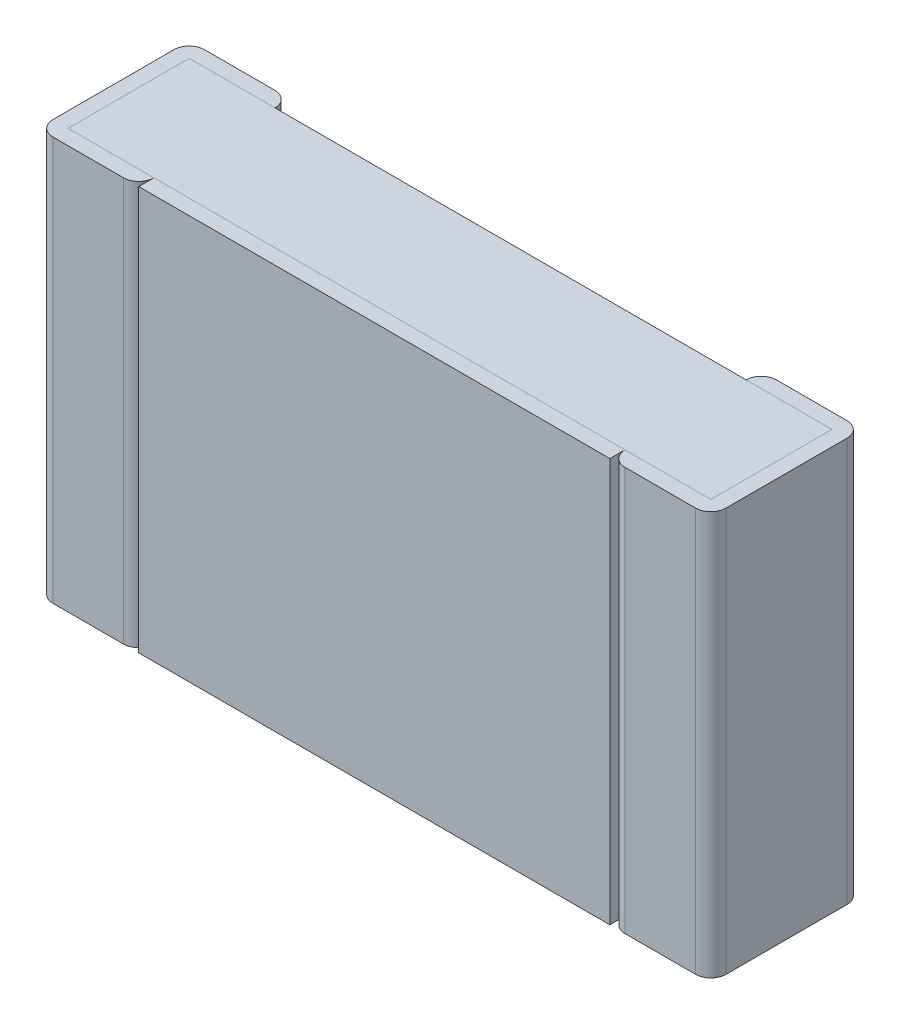
ISO-10303-21;
HEADER;
FILE_DESCRIPTION(('STEP AP214'),'2;1');
FILE_NAME('part.step','',(''),(''),'','','');
FILE_SCHEMA(('AUTOMOTIVE_DESIGN { 1 0 10303 214 1 1 1 1 }'));
ENDSEC;
DATA;
#1=APPLICATION_CONTEXT('core data for automotive mechanical design processes');
#2=APPLICATION_PROTOCOL_DEFINITION('international standard','automotive_design',2000,#1);
#3=PRODUCT_CONTEXT('',#1,'mechanical');
#4=PRODUCT('Part','Part','',(#3));
#5=PRODUCT_RELATED_PRODUCT_CATEGORY('part','',(#4));
#6=PRODUCT_DEFINITION_FORMATION('','',#4);
#7=PRODUCT_DEFINITION_CONTEXT('part definition',#1,'design');
#8=PRODUCT_DEFINITION('design','',#6,#7);
#9=PRODUCT_DEFINITION_SHAPE('','',#8);
#10=(LENGTH_UNIT() NAMED_UNIT(*) SI_UNIT(.MILLI.,.METRE.));
#11=(NAMED_UNIT(*) PLANE_ANGLE_UNIT() SI_UNIT($,.RADIAN.));
#12=(NAMED_UNIT(*) SI_UNIT($,.STERADIAN.) SOLID_ANGLE_UNIT());
#13=UNCERTAINTY_MEASURE_WITH_UNIT(LENGTH_MEASURE(1.E-05),#10,'distance_accuracy_value','');
#14=(GEOMETRIC_REPRESENTATION_CONTEXT(3) GLOBAL_UNCERTAINTY_ASSIGNED_CONTEXT((#13)) GLOBAL_UNIT_ASSIGNED_CONTEXT((#10,
#11,#12)) REPRESENTATION_CONTEXT('',''));
#15=CARTESIAN_POINT('',(0.,0.,0.));
#16=DIRECTION('',(0.,0.,1.));
#17=DIRECTION('',(1.,0.,0.));
#18=AXIS2_PLACEMENT_3D('',#15,#16,#17);
#19=CARTESIAN_POINT('',(-1.,-0.6,0.));
#20=DIRECTION('',(1.,0.,0.));
#21=DIRECTION('',(0.,1.,0.));
#22=AXIS2_PLACEMENT_3D('',#19,#20,#21);
#23=PLANE('',#22);
#24=DIRECTION('',(0.,1.,0.));
#25=VECTOR('',#24,1.);
#26=CARTESIAN_POINT('',(-1.,-0.6,0.405));
#27=LINE('',#26,#25);
#28=CARTESIAN_POINT('',(-1.,-0.6,0.405));
#29=VERTEX_POINT('',#28);
#30=CARTESIAN_POINT('',(-1.,0.6,0.405));
#31=VERTEX_POINT('',#30);
#32=EDGE_CURVE('E11',#29,#31,#27,.T.);
#33=ORIENTED_EDGE('',*,*,#32,.T.);
#34=DIRECTION('',(0.,0.,1.));
#35=VECTOR('',#34,1.);
#36=CARTESIAN_POINT('',(-1.,0.6,0.));
#37=LINE('',#36,#35);
#38=CARTESIAN_POINT('',(-1.,0.6,0.045));
#39=VERTEX_POINT('',#38);
#40=EDGE_CURVE('E41',#39,#31,#37,.T.);
#41=ORIENTED_EDGE('',*,*,#40,.F.);
#42=DIRECTION('',(0.,1.,0.));
#43=VECTOR('',#42,1.);
#44=CARTESIAN_POINT('',(-1.,-0.6,0.045));
#45=LINE('',#44,#43);
#46=CARTESIAN_POINT('',(-1.,-0.6,0.045));
#47=VERTEX_POINT('',#46);
#48=EDGE_CURVE('E361',#47,#39,#45,.T.);
#49=ORIENTED_EDGE('',*,*,#48,.F.);
#50=DIRECTION('',(0.,0.,1.));
#51=VECTOR('',#50,1.);
#52=CARTESIAN_POINT('',(-1.,-0.6,0.));
#53=LINE('',#52,#51);
#54=EDGE_CURVE('E27',#47,#29,#53,.T.);
#55=ORIENTED_EDGE('',*,*,#54,.T.);
#56=EDGE_LOOP('',(#33,#41,#49,#55));
#57=FACE_BOUND('',#56,.T.);
#58=ADVANCED_FACE('F16',(#57),#23,.F.);
#59=CARTESIAN_POINT('',(-1.,-0.6,0.));
#60=DIRECTION('',(0.,1.,0.));
#61=DIRECTION('',(1.,0.,0.));
#62=AXIS2_PLACEMENT_3D('',#59,#60,#61);
#63=PLANE('',#62);
#64=CARTESIAN_POINT('',(-0.745,-0.6,0.045));
#65=DIRECTION('',(0.,1.,0.));
#66=DIRECTION('',(0.,0.,1.));
#67=AXIS2_PLACEMENT_3D('',#64,#65,#66);
#68=CIRCLE('',#67,0.045);
#69=CARTESIAN_POINT('',(-0.7,-0.6,0.045));
#70=VERTEX_POINT('',#69);
#71=CARTESIAN_POINT('',(-0.745,-0.6,0.));
#72=VERTEX_POINT('',#71);
#73=EDGE_CURVE('E266',#70,#72,#68,.T.);
#74=ORIENTED_EDGE('',*,*,#73,.F.);
#75=DIRECTION('',(1.,0.,0.));
#76=VECTOR('',#75,1.);
#77=CARTESIAN_POINT('',(-0.955,-0.6,0.045));
#78=LINE('',#77,#76);
#79=CARTESIAN_POINT('',(-0.955,-0.6,0.045));
#80=VERTEX_POINT('',#79);
#81=EDGE_CURVE('E262',#80,#70,#78,.T.);
#82=ORIENTED_EDGE('',*,*,#81,.F.);
#83=DIRECTION('',(0.,0.,1.));
#84=VECTOR('',#83,1.);
#85=CARTESIAN_POINT('',(-0.955,-0.6,0.045));
#86=LINE('',#85,#84);
#87=CARTESIAN_POINT('',(-0.955,-0.6,0.405));
#88=VERTEX_POINT('',#87);
#89=EDGE_CURVE('E275',#80,#88,#86,.T.);
#90=ORIENTED_EDGE('',*,*,#89,.T.);
#91=DIRECTION('',(1.,0.,0.));
#92=VECTOR('',#91,1.);
#93=CARTESIAN_POINT('',(-0.955,-0.6,0.405));
#94=LINE('',#93,#92);
#95=CARTESIAN_POINT('',(-0.7,-0.6,0.405));
#96=VERTEX_POINT('',#95);
#97=EDGE_CURVE('E349',#88,#96,#94,.T.);
#98=ORIENTED_EDGE('',*,*,#97,.T.);
#99=CARTESIAN_POINT('',(-0.745,-0.6,0.405));
#100=DIRECTION('',(0.,-1.,0.));
#101=DIRECTION('',(0.,0.,1.));
#102=AXIS2_PLACEMENT_3D('',#99,#100,#101);
#103=CIRCLE('',#102,0.045);
#104=CARTESIAN_POINT('',(-0.745,-0.6,0.45));
#105=VERTEX_POINT('',#104);
#106=EDGE_CURVE('E240',#96,#105,#103,.T.);
#107=ORIENTED_EDGE('',*,*,#106,.T.);
#108=DIRECTION('',(1.,0.,0.));
#109=VECTOR('',#108,1.);
#110=CARTESIAN_POINT('',(-1.,-0.6,0.45));
#111=LINE('',#110,#109);
#112=CARTESIAN_POINT('',(-0.955,-0.6,0.45));
#113=VERTEX_POINT('',#112);
#114=EDGE_CURVE('E259',#113,#105,#111,.T.);
#115=ORIENTED_EDGE('',*,*,#114,.F.);
#116=CARTESIAN_POINT('',(-0.955,-0.6,0.405));
#117=DIRECTION('',(0.,1.,0.));
#118=DIRECTION('',(0.,0.,1.));
#119=AXIS2_PLACEMENT_3D('',#116,#117,#118);
#120=CIRCLE('',#119,0.045);
#121=EDGE_CURVE('E369',#29,#113,#120,.T.);
#122=ORIENTED_EDGE('',*,*,#121,.F.);
#123=ORIENTED_EDGE('',*,*,#54,.F.);
#124=CARTESIAN_POINT('',(-0.955,-0.6,0.045));
#125=DIRECTION('',(0.,-1.,0.));
#126=DIRECTION('',(0.,0.,1.));
#127=AXIS2_PLACEMENT_3D('',#124,#125,#126);
#128=CIRCLE('',#127,0.045);
#129=CARTESIAN_POINT('',(-0.955,-0.6,0.));
#130=VERTEX_POINT('',#129);
#131=EDGE_CURVE('E360',#47,#130,#128,.T.);
#132=ORIENTED_EDGE('',*,*,#131,.T.);
#133=DIRECTION('',(1.,0.,0.));
#134=VECTOR('',#133,1.);
#135=CARTESIAN_POINT('',(-1.,-0.6,0.));
#136=LINE('',#135,#134);
#137=EDGE_CURVE('E356',#130,#72,#136,.T.);
#138=ORIENTED_EDGE('',*,*,#137,.T.);
#139=EDGE_LOOP('',(#74,#82,#90,#98,#107,#115,#122,#123,#132,#138));
#140=FACE_BOUND('',#139,.T.);
#141=ADVANCED_FACE('F615',(#140),#63,.F.);
#142=CARTESIAN_POINT('',(-0.955,-0.6,0.045));
#143=DIRECTION('',(0.,1.,0.));
#144=DIRECTION('',(-1.,0.,0.));
#145=AXIS2_PLACEMENT_3D('',#142,#143,#144);
#146=CYLINDRICAL_SURFACE('',#145,0.045);
#147=ORIENTED_EDGE('',*,*,#48,.T.);
#148=CARTESIAN_POINT('',(-0.955,0.6,0.045));
#149=DIRECTION('',(0.,-1.,0.));
#150=DIRECTION('',(0.,0.,1.));
#151=AXIS2_PLACEMENT_3D('',#148,#149,#150);
#152=CIRCLE('',#151,0.045);
#153=CARTESIAN_POINT('',(-0.955,0.6,0.));
#154=VERTEX_POINT('',#153);
#155=EDGE_CURVE('E365',#39,#154,#152,.T.);
#156=ORIENTED_EDGE('',*,*,#155,.T.);
#157=DIRECTION('',(0.,1.,0.));
#158=VECTOR('',#157,1.);
#159=CARTESIAN_POINT('',(-0.955,-0.6,0.));
#160=LINE('',#159,#158);
#161=EDGE_CURVE('E252',#130,#154,#160,.T.);
#162=ORIENTED_EDGE('',*,*,#161,.F.);
#163=ORIENTED_EDGE('',*,*,#131,.F.);
#164=EDGE_LOOP('',(#147,#156,#162,#163));
#165=FACE_BOUND('',#164,.T.);
#166=ADVANCED_FACE('F611',(#165),#146,.T.);
#167=CARTESIAN_POINT('',(-0.955,-0.6,0.405));
#168=DIRECTION('',(0.,1.,0.));
#169=DIRECTION('',(-1.,0.,0.));
#170=AXIS2_PLACEMENT_3D('',#167,#168,#169);
#171=CYLINDRICAL_SURFACE('',#170,0.045);
#172=ORIENTED_EDGE('',*,*,#121,.T.);
#173=DIRECTION('',(0.,1.,0.));
#174=VECTOR('',#173,1.);
#175=CARTESIAN_POINT('',(-0.955,-0.6,0.45));
#176=LINE('',#175,#174);
#177=CARTESIAN_POINT('',(-0.955,0.6,0.45));
#178=VERTEX_POINT('',#177);
#179=EDGE_CURVE('E355',#113,#178,#176,.T.);
#180=ORIENTED_EDGE('',*,*,#179,.T.);
#181=CARTESIAN_POINT('',(-0.955,0.6,0.405));
#182=DIRECTION('',(0.,1.,0.));
#183=DIRECTION('',(0.,0.,1.));
#184=AXIS2_PLACEMENT_3D('',#181,#182,#183);
#185=CIRCLE('',#184,0.045);
#186=EDGE_CURVE('E315',#31,#178,#185,.T.);
#187=ORIENTED_EDGE('',*,*,#186,.F.);
#188=ORIENTED_EDGE('',*,*,#32,.F.);
#189=EDGE_LOOP('',(#172,#180,#187,#188));
#190=FACE_BOUND('',#189,.T.);
#191=ADVANCED_FACE('F581',(#190),#171,.T.);
#192=CARTESIAN_POINT('',(-1.,0.6,0.));
#193=DIRECTION('',(0.,1.,0.));
#194=DIRECTION('',(1.,0.,0.));
#195=AXIS2_PLACEMENT_3D('',#192,#193,#194);
#196=PLANE('',#195);
#197=DIRECTION('',(1.,0.,0.));
#198=VECTOR('',#197,1.);
#199=CARTESIAN_POINT('',(-1.,0.6,0.));
#200=LINE('',#199,#198);
#201=CARTESIAN_POINT('',(-0.745,0.6,0.));
#202=VERTEX_POINT('',#201);
#203=EDGE_CURVE('E194',#154,#202,#200,.T.);
#204=ORIENTED_EDGE('',*,*,#203,.F.);
#205=ORIENTED_EDGE('',*,*,#155,.F.);
#206=ORIENTED_EDGE('',*,*,#40,.T.);
#207=ORIENTED_EDGE('',*,*,#186,.T.);
#208=DIRECTION('',(1.,0.,0.));
#209=VECTOR('',#208,1.);
#210=CARTESIAN_POINT('',(-1.,0.6,0.45));
#211=LINE('',#210,#209);
#212=CARTESIAN_POINT('',(-0.745,0.6,0.45));
#213=VERTEX_POINT('',#212);
#214=EDGE_CURVE('E318',#178,#213,#211,.T.);
#215=ORIENTED_EDGE('',*,*,#214,.T.);
#216=CARTESIAN_POINT('',(-0.745,0.6,0.405));
#217=DIRECTION('',(0.,-1.,0.));
#218=DIRECTION('',(0.,0.,1.));
#219=AXIS2_PLACEMENT_3D('',#216,#217,#218);
#220=CIRCLE('',#219,0.045);
#221=CARTESIAN_POINT('',(-0.7,0.6,0.405));
#222=VERTEX_POINT('',#221);
#223=EDGE_CURVE('E412',#222,#213,#220,.T.);
#224=ORIENTED_EDGE('',*,*,#223,.F.);
#225=DIRECTION('',(1.,0.,0.));
#226=VECTOR('',#225,1.);
#227=CARTESIAN_POINT('',(-0.955,0.6,0.405));
#228=LINE('',#227,#226);
#229=CARTESIAN_POINT('',(-0.955,0.6,0.405));
#230=VERTEX_POINT('',#229);
#231=EDGE_CURVE('E267',#230,#222,#228,.T.);
#232=ORIENTED_EDGE('',*,*,#231,.F.);
#233=DIRECTION('',(0.,0.,1.));
#234=VECTOR('',#233,1.);
#235=CARTESIAN_POINT('',(-0.955,0.6,0.045));
#236=LINE('',#235,#234);
#237=CARTESIAN_POINT('',(-0.955,0.6,0.045));
#238=VERTEX_POINT('',#237);
#239=EDGE_CURVE('E271',#238,#230,#236,.T.);
#240=ORIENTED_EDGE('',*,*,#239,.F.);
#241=DIRECTION('',(1.,0.,0.));
#242=VECTOR('',#241,1.);
#243=CARTESIAN_POINT('',(-0.955,0.6,0.045));
#244=LINE('',#243,#242);
#245=CARTESIAN_POINT('',(-0.7,0.6,0.045));
#246=VERTEX_POINT('',#245);
#247=EDGE_CURVE('E413',#238,#246,#244,.T.);
#248=ORIENTED_EDGE('',*,*,#247,.T.);
#249=CARTESIAN_POINT('',(-0.745,0.6,0.045));
#250=DIRECTION('',(0.,1.,0.));
#251=DIRECTION('',(0.,0.,1.));
#252=AXIS2_PLACEMENT_3D('',#249,#250,#251);
#253=CIRCLE('',#252,0.045);
#254=EDGE_CURVE('E255',#246,#202,#253,.T.);
#255=ORIENTED_EDGE('',*,*,#254,.T.);
#256=EDGE_LOOP('',(#204,#205,#206,#207,#215,#224,#232,#240,#248,#255));
#257=FACE_BOUND('',#256,.T.);
#258=ADVANCED_FACE('F468',(#257),#196,.T.);
#259=CARTESIAN_POINT('',(-1.,-0.6,0.));
#260=DIRECTION('',(0.,0.,1.));
#261=DIRECTION('',(1.,0.,0.));
#262=AXIS2_PLACEMENT_3D('',#259,#260,#261);
#263=PLANE('',#262);
#264=DIRECTION('',(0.,1.,0.));
#265=VECTOR('',#264,1.);
#266=CARTESIAN_POINT('',(-0.745,-0.6,0.));
#267=LINE('',#266,#265);
#268=EDGE_CURVE('E250',#72,#202,#267,.T.);
#269=ORIENTED_EDGE('',*,*,#268,.F.);
#270=ORIENTED_EDGE('',*,*,#137,.F.);
#271=ORIENTED_EDGE('',*,*,#161,.T.);
#272=ORIENTED_EDGE('',*,*,#203,.T.);
#273=EDGE_LOOP('',(#269,#270,#271,#272));
#274=FACE_BOUND('',#273,.T.);
#275=ADVANCED_FACE('F474',(#274),#263,.F.);
#276=CARTESIAN_POINT('',(-0.745,-0.6,0.045));
#277=DIRECTION('',(0.,1.,0.));
#278=DIRECTION('',(1.,0.,0.));
#279=AXIS2_PLACEMENT_3D('',#276,#277,#278);
#280=CYLINDRICAL_SURFACE('',#279,0.045);
#281=ORIENTED_EDGE('',*,*,#73,.T.);
#282=ORIENTED_EDGE('',*,*,#268,.T.);
#283=ORIENTED_EDGE('',*,*,#254,.F.);
#284=DIRECTION('',(0.,1.,0.));
#285=VECTOR('',#284,1.);
#286=CARTESIAN_POINT('',(-0.7,-0.6,0.045));
#287=LINE('',#286,#285);
#288=EDGE_CURVE('E205',#70,#246,#287,.T.);
#289=ORIENTED_EDGE('',*,*,#288,.F.);
#290=EDGE_LOOP('',(#281,#282,#283,#289));
#291=FACE_BOUND('',#290,.T.);
#292=ADVANCED_FACE('F472',(#291),#280,.T.);
#293=CARTESIAN_POINT('',(-0.955,-0.6,0.045));
#294=DIRECTION('',(0.,1.,0.));
#295=DIRECTION('',(1.,0.,0.));
#296=AXIS2_PLACEMENT_3D('',#293,#294,#295);
#297=PLANE('',#296);
#298=DIRECTION('',(1.,0.,0.));
#299=VECTOR('',#298,1.);
#300=CARTESIAN_POINT('',(-0.955,-0.6,0.045));
#301=LINE('',#300,#299);
#302=CARTESIAN_POINT('',(0.7,-0.6,0.045));
#303=VERTEX_POINT('',#302);
#304=EDGE_CURVE('E246',#70,#303,#301,.T.);
#305=ORIENTED_EDGE('',*,*,#304,.T.);
#306=DIRECTION('',(1.,0.,0.));
#307=VECTOR('',#306,1.);
#308=CARTESIAN_POINT('',(-0.955,-0.6,0.045));
#309=LINE('',#308,#307);
#310=CARTESIAN_POINT('',(0.955,-0.6,0.045));
#311=VERTEX_POINT('',#310);
#312=EDGE_CURVE('E251',#303,#311,#309,.T.);
#313=ORIENTED_EDGE('',*,*,#312,.T.);
#314=DIRECTION('',(0.,0.,1.));
#315=VECTOR('',#314,1.);
#316=CARTESIAN_POINT('',(0.955,-0.6,0.045));
#317=LINE('',#316,#315);
#318=CARTESIAN_POINT('',(0.955,-0.6,0.405));
#319=VERTEX_POINT('',#318);
#320=EDGE_CURVE('E281',#311,#319,#317,.T.);
#321=ORIENTED_EDGE('',*,*,#320,.T.);
#322=DIRECTION('',(1.,0.,0.));
#323=VECTOR('',#322,1.);
#324=CARTESIAN_POINT('',(-0.955,-0.6,0.405));
#325=LINE('',#324,#323);
#326=CARTESIAN_POINT('',(0.7,-0.6,0.405));
#327=VERTEX_POINT('',#326);
#328=EDGE_CURVE('E364',#327,#319,#325,.T.);
#329=ORIENTED_EDGE('',*,*,#328,.F.);
#330=DIRECTION('',(1.,0.,0.));
#331=VECTOR('',#330,1.);
#332=CARTESIAN_POINT('',(-0.7,-0.6,0.405));
#333=LINE('',#332,#331);
#334=EDGE_CURVE('E293',#96,#327,#333,.T.);
#335=ORIENTED_EDGE('',*,*,#334,.F.);
#336=ORIENTED_EDGE('',*,*,#97,.F.);
#337=ORIENTED_EDGE('',*,*,#89,.F.);
#338=ORIENTED_EDGE('',*,*,#81,.T.);
#339=EDGE_LOOP('',(#305,#313,#321,#329,#335,#336,#337,#338));
#340=FACE_BOUND('',#339,.T.);
#341=ADVANCED_FACE('F518',(#340),#297,.F.);
#342=CARTESIAN_POINT('',(-1.,-0.6,0.45));
#343=DIRECTION('',(0.,0.,1.));
#344=DIRECTION('',(1.,0.,0.));
#345=AXIS2_PLACEMENT_3D('',#342,#343,#344);
#346=PLANE('',#345);
#347=ORIENTED_EDGE('',*,*,#214,.F.);
#348=ORIENTED_EDGE('',*,*,#179,.F.);
#349=ORIENTED_EDGE('',*,*,#114,.T.);
#350=DIRECTION('',(0.,1.,0.));
#351=VECTOR('',#350,1.);
#352=CARTESIAN_POINT('',(-0.745,-0.6,0.45));
#353=LINE('',#352,#351);
#354=EDGE_CURVE('E263',#105,#213,#353,.T.);
#355=ORIENTED_EDGE('',*,*,#354,.T.);
#356=EDGE_LOOP('',(#347,#348,#349,#355));
#357=FACE_BOUND('',#356,.T.);
#358=ADVANCED_FACE('F511',(#357),#346,.T.);
#359=CARTESIAN_POINT('',(-0.745,-0.6,0.405));
#360=DIRECTION('',(0.,1.,0.));
#361=DIRECTION('',(1.,0.,0.));
#362=AXIS2_PLACEMENT_3D('',#359,#360,#361);
#363=CYLINDRICAL_SURFACE('',#362,0.045);
#364=DIRECTION('',(0.,1.,0.));
#365=VECTOR('',#364,1.);
#366=CARTESIAN_POINT('',(-0.7,-0.6,0.405));
#367=LINE('',#366,#365);
#368=EDGE_CURVE('E382',#96,#222,#367,.T.);
#369=ORIENTED_EDGE('',*,*,#368,.T.);
#370=ORIENTED_EDGE('',*,*,#223,.T.);
#371=ORIENTED_EDGE('',*,*,#354,.F.);
#372=ORIENTED_EDGE('',*,*,#106,.F.);
#373=EDGE_LOOP('',(#369,#370,#371,#372));
#374=FACE_BOUND('',#373,.T.);
#375=ADVANCED_FACE('F517',(#374),#363,.T.);
#376=CARTESIAN_POINT('',(-0.955,0.6,0.045));
#377=DIRECTION('',(0.,1.,0.));
#378=DIRECTION('',(1.,0.,0.));
#379=AXIS2_PLACEMENT_3D('',#376,#377,#378);
#380=PLANE('',#379);
#381=ORIENTED_EDGE('',*,*,#247,.F.);
#382=ORIENTED_EDGE('',*,*,#239,.T.);
#383=ORIENTED_EDGE('',*,*,#231,.T.);
#384=DIRECTION('',(1.,0.,0.));
#385=VECTOR('',#384,1.);
#386=CARTESIAN_POINT('',(-0.7,0.6,0.405));
#387=LINE('',#386,#385);
#388=CARTESIAN_POINT('',(0.7,0.6,0.405));
#389=VERTEX_POINT('',#388);
#390=EDGE_CURVE('E244',#222,#389,#387,.T.);
#391=ORIENTED_EDGE('',*,*,#390,.T.);
#392=DIRECTION('',(1.,0.,0.));
#393=VECTOR('',#392,1.);
#394=CARTESIAN_POINT('',(-0.955,0.6,0.405));
#395=LINE('',#394,#393);
#396=CARTESIAN_POINT('',(0.955,0.6,0.405));
#397=VERTEX_POINT('',#396);
#398=EDGE_CURVE('E242',#389,#397,#395,.T.);
#399=ORIENTED_EDGE('',*,*,#398,.T.);
#400=DIRECTION('',(0.,0.,1.));
#401=VECTOR('',#400,1.);
#402=CARTESIAN_POINT('',(0.955,0.6,0.045));
#403=LINE('',#402,#401);
#404=CARTESIAN_POINT('',(0.955,0.6,0.045));
#405=VERTEX_POINT('',#404);
#406=EDGE_CURVE('E339',#405,#397,#403,.T.);
#407=ORIENTED_EDGE('',*,*,#406,.F.);
#408=DIRECTION('',(1.,0.,0.));
#409=VECTOR('',#408,1.);
#410=CARTESIAN_POINT('',(-0.955,0.6,0.045));
#411=LINE('',#410,#409);
#412=CARTESIAN_POINT('',(0.7,0.6,0.045));
#413=VERTEX_POINT('',#412);
#414=EDGE_CURVE('E335',#413,#405,#411,.T.);
#415=ORIENTED_EDGE('',*,*,#414,.F.);
#416=DIRECTION('',(1.,0.,0.));
#417=VECTOR('',#416,1.);
#418=CARTESIAN_POINT('',(-0.955,0.6,0.045));
#419=LINE('',#418,#417);
#420=EDGE_CURVE('E245',#246,#413,#419,.T.);
#421=ORIENTED_EDGE('',*,*,#420,.F.);
#422=EDGE_LOOP('',(#381,#382,#383,#391,#399,#407,#415,#421));
#423=FACE_BOUND('',#422,.T.);
#424=ADVANCED_FACE('F671',(#423),#380,.T.);
#425=CARTESIAN_POINT('',(-0.955,-0.6,0.045));
#426=DIRECTION('',(0.,0.,1.));
#427=DIRECTION('',(1.,0.,0.));
#428=AXIS2_PLACEMENT_3D('',#425,#426,#427);
#429=PLANE('',#428);
#430=ORIENTED_EDGE('',*,*,#420,.T.);
#431=DIRECTION('',(0.,1.,0.));
#432=VECTOR('',#431,1.);
#433=CARTESIAN_POINT('',(0.7,-0.6,0.045));
#434=LINE('',#433,#432);
#435=EDGE_CURVE('E225',#303,#413,#434,.T.);
#436=ORIENTED_EDGE('',*,*,#435,.F.);
#437=ORIENTED_EDGE('',*,*,#304,.F.);
#438=ORIENTED_EDGE('',*,*,#288,.T.);
#439=EDGE_LOOP('',(#430,#436,#437,#438));
#440=FACE_BOUND('',#439,.T.);
#441=ADVANCED_FACE('F667',(#440),#429,.F.);
#442=CARTESIAN_POINT('',(0.7,-0.6,0.));
#443=DIRECTION('',(0.,1.,0.));
#444=DIRECTION('',(1.,0.,0.));
#445=AXIS2_PLACEMENT_3D('',#442,#443,#444);
#446=PLANE('',#445);
#447=CARTESIAN_POINT('',(0.955,-0.6,0.045));
#448=DIRECTION('',(0.,1.,0.));
#449=DIRECTION('',(0.,0.,1.));
#450=AXIS2_PLACEMENT_3D('',#447,#448,#449);
#451=CIRCLE('',#450,0.045);
#452=CARTESIAN_POINT('',(1.,-0.6,0.045));
#453=VERTEX_POINT('',#452);
#454=CARTESIAN_POINT('',(0.955,-0.6,0.));
#455=VERTEX_POINT('',#454);
#456=EDGE_CURVE('E219',#453,#455,#451,.T.);
#457=ORIENTED_EDGE('',*,*,#456,.F.);
#458=DIRECTION('',(0.,0.,1.));
#459=VECTOR('',#458,1.);
#460=CARTESIAN_POINT('',(1.,-0.6,0.));
#461=LINE('',#460,#459);
#462=CARTESIAN_POINT('',(1.,-0.6,0.405));
#463=VERTEX_POINT('',#462);
#464=EDGE_CURVE('E387',#453,#463,#461,.T.);
#465=ORIENTED_EDGE('',*,*,#464,.T.);
#466=CARTESIAN_POINT('',(0.955,-0.6,0.405));
#467=DIRECTION('',(0.,-1.,0.));
#468=DIRECTION('',(0.,0.,1.));
#469=AXIS2_PLACEMENT_3D('',#466,#467,#468);
#470=CIRCLE('',#469,0.045);
#471=CARTESIAN_POINT('',(0.955,-0.6,0.45));
#472=VERTEX_POINT('',#471);
#473=EDGE_CURVE('E383',#463,#472,#470,.T.);
#474=ORIENTED_EDGE('',*,*,#473,.T.);
#475=DIRECTION('',(1.,0.,0.));
#476=VECTOR('',#475,1.);
#477=CARTESIAN_POINT('',(0.7,-0.6,0.45));
#478=LINE('',#477,#476);
#479=CARTESIAN_POINT('',(0.745,-0.6,0.45));
#480=VERTEX_POINT('',#479);
#481=EDGE_CURVE('E402',#480,#472,#478,.T.);
#482=ORIENTED_EDGE('',*,*,#481,.F.);
#483=CARTESIAN_POINT('',(0.745,-0.6,0.405));
#484=DIRECTION('',(0.,1.,0.));
#485=DIRECTION('',(0.,0.,1.));
#486=AXIS2_PLACEMENT_3D('',#483,#484,#485);
#487=CIRCLE('',#486,0.045);
#488=EDGE_CURVE('E311',#327,#480,#487,.T.);
#489=ORIENTED_EDGE('',*,*,#488,.F.);
#490=ORIENTED_EDGE('',*,*,#328,.T.);
#491=ORIENTED_EDGE('',*,*,#320,.F.);
#492=ORIENTED_EDGE('',*,*,#312,.F.);
#493=CARTESIAN_POINT('',(0.745,-0.6,0.045));
#494=DIRECTION('',(0.,-1.,0.));
#495=DIRECTION('',(0.,0.,1.));
#496=AXIS2_PLACEMENT_3D('',#493,#494,#495);
#497=CIRCLE('',#496,0.045);
#498=CARTESIAN_POINT('',(0.745,-0.6,0.));
#499=VERTEX_POINT('',#498);
#500=EDGE_CURVE('E314',#303,#499,#497,.T.);
#501=ORIENTED_EDGE('',*,*,#500,.T.);
#502=DIRECTION('',(1.,0.,0.));
#503=VECTOR('',#502,1.);
#504=CARTESIAN_POINT('',(0.7,-0.6,0.));
#505=LINE('',#504,#503);
#506=EDGE_CURVE('E231',#499,#455,#505,.T.);
#507=ORIENTED_EDGE('',*,*,#506,.T.);
#508=EDGE_LOOP('',(#457,#465,#474,#482,#489,#490,#491,#492,#501,#507));
#509=FACE_BOUND('',#508,.T.);
#510=ADVANCED_FACE('F18',(#509),#446,.F.);
#511=CARTESIAN_POINT('',(-0.7,-0.6,0.405));
#512=DIRECTION('',(0.,1.,0.));
#513=DIRECTION('',(1.,0.,0.));
#514=AXIS2_PLACEMENT_3D('',#511,#512,#513);
#515=PLANE('',#514);
#516=DIRECTION('',(0.,0.,1.));
#517=VECTOR('',#516,1.);
#518=CARTESIAN_POINT('',(0.7,-0.6,0.405));
#519=LINE('',#518,#517);
#520=CARTESIAN_POINT('',(0.7,-0.6,0.45));
#521=VERTEX_POINT('',#520);
#522=EDGE_CURVE('E297',#327,#521,#519,.T.);
#523=ORIENTED_EDGE('',*,*,#522,.T.);
#524=DIRECTION('',(1.,0.,0.));
#525=VECTOR('',#524,1.);
#526=CARTESIAN_POINT('',(-0.7,-0.6,0.45));
#527=LINE('',#526,#525);
#528=CARTESIAN_POINT('',(-0.7,-0.6,0.45));
#529=VERTEX_POINT('',#528);
#530=EDGE_CURVE('E280',#529,#521,#527,.T.);
#531=ORIENTED_EDGE('',*,*,#530,.F.);
#532=DIRECTION('',(0.,0.,1.));
#533=VECTOR('',#532,1.);
#534=CARTESIAN_POINT('',(-0.7,-0.6,0.405));
#535=LINE('',#534,#533);
#536=EDGE_CURVE('E338',#96,#529,#535,.T.);
#537=ORIENTED_EDGE('',*,*,#536,.F.);
#538=ORIENTED_EDGE('',*,*,#334,.T.);
#539=EDGE_LOOP('',(#523,#531,#537,#538));
#540=FACE_BOUND('',#539,.T.);
#541=ADVANCED_FACE('F495',(#540),#515,.F.);
#542=CARTESIAN_POINT('',(-0.7,-0.6,0.405));
#543=DIRECTION('',(1.,0.,0.));
#544=DIRECTION('',(0.,1.,0.));
#545=AXIS2_PLACEMENT_3D('',#542,#543,#544);
#546=PLANE('',#545);
#547=DIRECTION('',(0.,1.,0.));
#548=VECTOR('',#547,1.);
#549=CARTESIAN_POINT('',(-0.7,-0.6,0.45));
#550=LINE('',#549,#548);
#551=CARTESIAN_POINT('',(-0.7,0.6,0.45));
#552=VERTEX_POINT('',#551);
#553=EDGE_CURVE('E298',#529,#552,#550,.T.);
#554=ORIENTED_EDGE('',*,*,#553,.T.);
#555=DIRECTION('',(0.,0.,1.));
#556=VECTOR('',#555,1.);
#557=CARTESIAN_POINT('',(-0.7,0.6,0.405));
#558=LINE('',#557,#556);
#559=EDGE_CURVE('E256',#222,#552,#558,.T.);
#560=ORIENTED_EDGE('',*,*,#559,.F.);
#561=ORIENTED_EDGE('',*,*,#368,.F.);
#562=ORIENTED_EDGE('',*,*,#536,.T.);
#563=EDGE_LOOP('',(#554,#560,#561,#562));
#564=FACE_BOUND('',#563,.T.);
#565=ADVANCED_FACE('F500',(#564),#546,.F.);
#566=CARTESIAN_POINT('',(0.7,0.6,0.));
#567=DIRECTION('',(0.,1.,0.));
#568=DIRECTION('',(1.,0.,0.));
#569=AXIS2_PLACEMENT_3D('',#566,#567,#568);
#570=PLANE('',#569);
#571=DIRECTION('',(1.,0.,0.));
#572=VECTOR('',#571,1.);
#573=CARTESIAN_POINT('',(0.7,0.6,0.));
#574=LINE('',#573,#572);
#575=CARTESIAN_POINT('',(0.745,0.6,0.));
#576=VERTEX_POINT('',#575);
#577=CARTESIAN_POINT('',(0.955,0.6,0.));
#578=VERTEX_POINT('',#577);
#579=EDGE_CURVE('E170',#576,#578,#574,.T.);
#580=ORIENTED_EDGE('',*,*,#579,.F.);
#581=CARTESIAN_POINT('',(0.745,0.6,0.045));
#582=DIRECTION('',(0.,-1.,0.));
#583=DIRECTION('',(0.,0.,1.));
#584=AXIS2_PLACEMENT_3D('',#581,#582,#583);
#585=CIRCLE('',#584,0.045);
#586=EDGE_CURVE('E214',#413,#576,#585,.T.);
#587=ORIENTED_EDGE('',*,*,#586,.F.);
#588=ORIENTED_EDGE('',*,*,#414,.T.);
#589=ORIENTED_EDGE('',*,*,#406,.T.);
#590=ORIENTED_EDGE('',*,*,#398,.F.);
#591=CARTESIAN_POINT('',(0.745,0.6,0.405));
#592=DIRECTION('',(0.,1.,0.));
#593=DIRECTION('',(0.,0.,1.));
#594=AXIS2_PLACEMENT_3D('',#591,#592,#593);
#595=CIRCLE('',#594,0.045);
#596=CARTESIAN_POINT('',(0.745,0.6,0.45));
#597=VERTEX_POINT('',#596);
#598=EDGE_CURVE('E329',#389,#597,#595,.T.);
#599=ORIENTED_EDGE('',*,*,#598,.T.);
#600=DIRECTION('',(1.,0.,0.));
#601=VECTOR('',#600,1.);
#602=CARTESIAN_POINT('',(0.7,0.6,0.45));
#603=LINE('',#602,#601);
#604=CARTESIAN_POINT('',(0.955,0.6,0.45));
#605=VERTEX_POINT('',#604);
#606=EDGE_CURVE('E325',#597,#605,#603,.T.);
#607=ORIENTED_EDGE('',*,*,#606,.T.);
#608=CARTESIAN_POINT('',(0.955,0.6,0.405));
#609=DIRECTION('',(0.,-1.,0.));
#610=DIRECTION('',(0.,0.,1.));
#611=AXIS2_PLACEMENT_3D('',#608,#609,#610);
#612=CIRCLE('',#611,0.045);
#613=CARTESIAN_POINT('',(1.,0.6,0.405));
#614=VERTEX_POINT('',#613);
#615=EDGE_CURVE('E306',#614,#605,#612,.T.);
#616=ORIENTED_EDGE('',*,*,#615,.F.);
#617=DIRECTION('',(0.,0.,1.));
#618=VECTOR('',#617,1.);
#619=CARTESIAN_POINT('',(1.,0.6,0.));
#620=LINE('',#619,#618);
#621=CARTESIAN_POINT('',(1.,0.6,0.045));
#622=VERTEX_POINT('',#621);
#623=EDGE_CURVE('E158',#622,#614,#620,.T.);
#624=ORIENTED_EDGE('',*,*,#623,.F.);
#625=CARTESIAN_POINT('',(0.955,0.6,0.045));
#626=DIRECTION('',(0.,1.,0.));
#627=DIRECTION('',(0.,0.,1.));
#628=AXIS2_PLACEMENT_3D('',#625,#626,#627);
#629=CIRCLE('',#628,0.045);
#630=EDGE_CURVE('E215',#622,#578,#629,.T.);
#631=ORIENTED_EDGE('',*,*,#630,.T.);
#632=EDGE_LOOP('',(#580,#587,#588,#589,#590,#599,#607,#616,#624,#631));
#633=FACE_BOUND('',#632,.T.);
#634=ADVANCED_FACE('F212',(#633),#570,.T.);
#635=CARTESIAN_POINT('',(-0.7,0.6,0.405));
#636=DIRECTION('',(0.,1.,0.));
#637=DIRECTION('',(1.,0.,0.));
#638=AXIS2_PLACEMENT_3D('',#635,#636,#637);
#639=PLANE('',#638);
#640=ORIENTED_EDGE('',*,*,#390,.F.);
#641=ORIENTED_EDGE('',*,*,#559,.T.);
#642=DIRECTION('',(1.,0.,0.));
#643=VECTOR('',#642,1.);
#644=CARTESIAN_POINT('',(-0.7,0.6,0.45));
#645=LINE('',#644,#643);
#646=CARTESIAN_POINT('',(0.7,0.6,0.45));
#647=VERTEX_POINT('',#646);
#648=EDGE_CURVE('E20',#552,#647,#645,.T.);
#649=ORIENTED_EDGE('',*,*,#648,.T.);
#650=DIRECTION('',(0.,0.,1.));
#651=VECTOR('',#650,1.);
#652=CARTESIAN_POINT('',(0.7,0.6,0.405));
#653=LINE('',#652,#651);
#654=EDGE_CURVE('E276',#389,#647,#653,.T.);
#655=ORIENTED_EDGE('',*,*,#654,.F.);
#656=EDGE_LOOP('',(#640,#641,#649,#655));
#657=FACE_BOUND('',#656,.T.);
#658=ADVANCED_FACE('F649',(#657),#639,.T.);
#659=CARTESIAN_POINT('',(0.745,-0.6,0.045));
#660=DIRECTION('',(0.,1.,0.));
#661=DIRECTION('',(-1.,0.,0.));
#662=AXIS2_PLACEMENT_3D('',#659,#660,#661);
#663=CYLINDRICAL_SURFACE('',#662,0.045);
#664=ORIENTED_EDGE('',*,*,#435,.T.);
#665=ORIENTED_EDGE('',*,*,#586,.T.);
#666=DIRECTION('',(0.,1.,0.));
#667=VECTOR('',#666,1.);
#668=CARTESIAN_POINT('',(0.745,-0.6,0.));
#669=LINE('',#668,#667);
#670=EDGE_CURVE('E218',#499,#576,#669,.T.);
#671=ORIENTED_EDGE('',*,*,#670,.F.);
#672=ORIENTED_EDGE('',*,*,#500,.F.);
#673=EDGE_LOOP('',(#664,#665,#671,#672));
#674=FACE_BOUND('',#673,.T.);
#675=ADVANCED_FACE('F223',(#674),#663,.T.);
#676=CARTESIAN_POINT('',(0.7,-0.6,0.));
#677=DIRECTION('',(0.,0.,1.));
#678=DIRECTION('',(1.,0.,0.));
#679=AXIS2_PLACEMENT_3D('',#676,#677,#678);
#680=PLANE('',#679);
#681=DIRECTION('',(0.,1.,0.));
#682=VECTOR('',#681,1.);
#683=CARTESIAN_POINT('',(0.955,-0.6,0.));
#684=LINE('',#683,#682);
#685=EDGE_CURVE('E288',#455,#578,#684,.T.);
#686=ORIENTED_EDGE('',*,*,#685,.F.);
#687=ORIENTED_EDGE('',*,*,#506,.F.);
#688=ORIENTED_EDGE('',*,*,#670,.T.);
#689=ORIENTED_EDGE('',*,*,#579,.T.);
#690=EDGE_LOOP('',(#686,#687,#688,#689));
#691=FACE_BOUND('',#690,.T.);
#692=ADVANCED_FACE('F229',(#691),#680,.F.);
#693=CARTESIAN_POINT('',(0.955,-0.6,0.045));
#694=DIRECTION('',(0.,1.,0.));
#695=DIRECTION('',(1.,0.,0.));
#696=AXIS2_PLACEMENT_3D('',#693,#694,#695);
#697=CYLINDRICAL_SURFACE('',#696,0.045);
#698=ORIENTED_EDGE('',*,*,#456,.T.);
#699=ORIENTED_EDGE('',*,*,#685,.T.);
#700=ORIENTED_EDGE('',*,*,#630,.F.);
#701=DIRECTION('',(0.,1.,0.));
#702=VECTOR('',#701,1.);
#703=CARTESIAN_POINT('',(1.,-0.6,0.045));
#704=LINE('',#703,#702);
#705=EDGE_CURVE('E284',#453,#622,#704,.T.);
#706=ORIENTED_EDGE('',*,*,#705,.F.);
#707=EDGE_LOOP('',(#698,#699,#700,#706));
#708=FACE_BOUND('',#707,.T.);
#709=ADVANCED_FACE('F568',(#708),#697,.T.);
#710=CARTESIAN_POINT('',(1.,-0.6,0.));
#711=DIRECTION('',(1.,0.,0.));
#712=DIRECTION('',(0.,1.,0.));
#713=AXIS2_PLACEMENT_3D('',#710,#711,#712);
#714=PLANE('',#713);
#715=ORIENTED_EDGE('',*,*,#464,.F.);
#716=ORIENTED_EDGE('',*,*,#705,.T.);
#717=ORIENTED_EDGE('',*,*,#623,.T.);
#718=DIRECTION('',(0.,1.,0.));
#719=VECTOR('',#718,1.);
#720=CARTESIAN_POINT('',(1.,-0.6,0.405));
#721=LINE('',#720,#719);
#722=EDGE_CURVE('E302',#463,#614,#721,.T.);
#723=ORIENTED_EDGE('',*,*,#722,.F.);
#724=EDGE_LOOP('',(#715,#716,#717,#723));
#725=FACE_BOUND('',#724,.T.);
#726=ADVANCED_FACE('F458',(#725),#714,.T.);
#727=CARTESIAN_POINT('',(0.955,-0.6,0.405));
#728=DIRECTION('',(0.,1.,0.));
#729=DIRECTION('',(1.,0.,0.));
#730=AXIS2_PLACEMENT_3D('',#727,#728,#729);
#731=CYLINDRICAL_SURFACE('',#730,0.045);
#732=ORIENTED_EDGE('',*,*,#722,.T.);
#733=ORIENTED_EDGE('',*,*,#615,.T.);
#734=DIRECTION('',(0.,1.,0.));
#735=VECTOR('',#734,1.);
#736=CARTESIAN_POINT('',(0.955,-0.6,0.45));
#737=LINE('',#736,#735);
#738=EDGE_CURVE('E405',#472,#605,#737,.T.);
#739=ORIENTED_EDGE('',*,*,#738,.F.);
#740=ORIENTED_EDGE('',*,*,#473,.F.);
#741=EDGE_LOOP('',(#732,#733,#739,#740));
#742=FACE_BOUND('',#741,.T.);
#743=ADVANCED_FACE('F460',(#742),#731,.T.);
#744=CARTESIAN_POINT('',(0.7,-0.6,0.45));
#745=DIRECTION('',(0.,0.,1.));
#746=DIRECTION('',(1.,0.,0.));
#747=AXIS2_PLACEMENT_3D('',#744,#745,#746);
#748=PLANE('',#747);
#749=ORIENTED_EDGE('',*,*,#606,.F.);
#750=DIRECTION('',(0.,1.,0.));
#751=VECTOR('',#750,1.);
#752=CARTESIAN_POINT('',(0.745,-0.6,0.45));
#753=LINE('',#752,#751);
#754=EDGE_CURVE('E307',#480,#597,#753,.T.);
#755=ORIENTED_EDGE('',*,*,#754,.F.);
#756=ORIENTED_EDGE('',*,*,#481,.T.);
#757=ORIENTED_EDGE('',*,*,#738,.T.);
#758=EDGE_LOOP('',(#749,#755,#756,#757));
#759=FACE_BOUND('',#758,.T.);
#760=ADVANCED_FACE('F551',(#759),#748,.T.);
#761=CARTESIAN_POINT('',(0.745,-0.6,0.405));
#762=DIRECTION('',(0.,1.,0.));
#763=DIRECTION('',(-1.,0.,0.));
#764=AXIS2_PLACEMENT_3D('',#761,#762,#763);
#765=CYLINDRICAL_SURFACE('',#764,0.045);
#766=ORIENTED_EDGE('',*,*,#488,.T.);
#767=ORIENTED_EDGE('',*,*,#754,.T.);
#768=ORIENTED_EDGE('',*,*,#598,.F.);
#769=DIRECTION('',(0.,1.,0.));
#770=VECTOR('',#769,1.);
#771=CARTESIAN_POINT('',(0.7,-0.6,0.405));
#772=LINE('',#771,#770);
#773=EDGE_CURVE('E279',#327,#389,#772,.T.);
#774=ORIENTED_EDGE('',*,*,#773,.F.);
#775=EDGE_LOOP('',(#766,#767,#768,#774));
#776=FACE_BOUND('',#775,.T.);
#777=ADVANCED_FACE('F540',(#776),#765,.T.);
#778=CARTESIAN_POINT('',(0.7,-0.6,0.405));
#779=DIRECTION('',(1.,0.,0.));
#780=DIRECTION('',(0.,1.,0.));
#781=AXIS2_PLACEMENT_3D('',#778,#779,#780);
#782=PLANE('',#781);
#783=ORIENTED_EDGE('',*,*,#522,.F.);
#784=ORIENTED_EDGE('',*,*,#773,.T.);
#785=ORIENTED_EDGE('',*,*,#654,.T.);
#786=DIRECTION('',(0.,1.,0.));
#787=VECTOR('',#786,1.);
#788=CARTESIAN_POINT('',(0.7,-0.6,0.45));
#789=LINE('',#788,#787);
#790=EDGE_CURVE('E321',#521,#647,#789,.T.);
#791=ORIENTED_EDGE('',*,*,#790,.F.);
#792=EDGE_LOOP('',(#783,#784,#785,#791));
#793=FACE_BOUND('',#792,.T.);
#794=ADVANCED_FACE('F530',(#793),#782,.T.);
#795=CARTESIAN_POINT('',(-0.7,-0.6,0.45));
#796=DIRECTION('',(0.,0.,1.));
#797=DIRECTION('',(1.,0.,0.));
#798=AXIS2_PLACEMENT_3D('',#795,#796,#797);
#799=PLANE('',#798);
#800=ORIENTED_EDGE('',*,*,#553,.F.);
#801=ORIENTED_EDGE('',*,*,#530,.T.);
#802=ORIENTED_EDGE('',*,*,#790,.T.);
#803=ORIENTED_EDGE('',*,*,#648,.F.);
#804=EDGE_LOOP('',(#800,#801,#802,#803));
#805=FACE_BOUND('',#804,.T.);
#806=ADVANCED_FACE('F504',(#805),#799,.T.);
#807=CLOSED_SHELL('',(#58,#141,#166,#191,#258,#275,#292,#341,#358,#375,#424,#441,#510,#541,#565,
#634,#658,#675,#692,#709,#726,#743,#760,#777,#794,#806));
#808=MANIFOLD_SOLID_BREP('B1',#807);
#809=ADVANCED_BREP_SHAPE_REPRESENTATION('',(#18,#808),#14);
#810=SHAPE_DEFINITION_REPRESENTATION(#9,#809);
ENDSEC;
END-ISO-10303-21;
